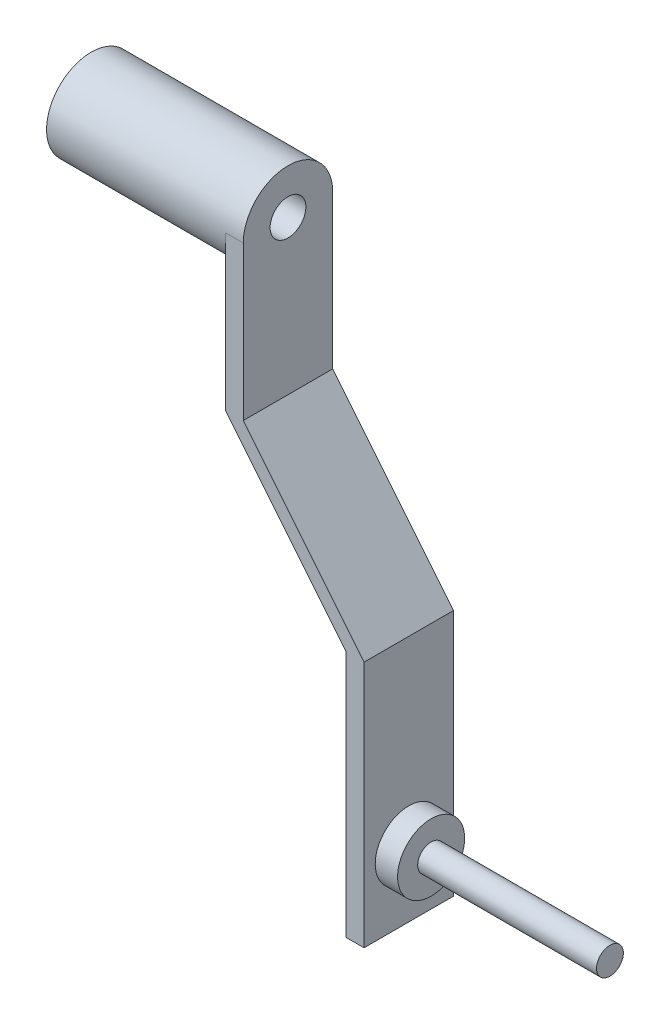
ISO-10303-21;
HEADER;
FILE_DESCRIPTION(('STEP AP214'),'2;1');
FILE_NAME('part.step','',(''),(''),'','','');
FILE_SCHEMA(('AUTOMOTIVE_DESIGN { 1 0 10303 214 1 1 1 1 }'));
ENDSEC;
DATA;
#1=APPLICATION_CONTEXT('core data for automotive mechanical design processes');
#2=APPLICATION_PROTOCOL_DEFINITION('international standard','automotive_design',2000,#1);
#3=PRODUCT_CONTEXT('',#1,'mechanical');
#4=PRODUCT('Part','Part','',(#3));
#5=PRODUCT_RELATED_PRODUCT_CATEGORY('part','',(#4));
#6=PRODUCT_DEFINITION_FORMATION('','',#4);
#7=PRODUCT_DEFINITION_CONTEXT('part definition',#1,'design');
#8=PRODUCT_DEFINITION('design','',#6,#7);
#9=PRODUCT_DEFINITION_SHAPE('','',#8);
#10=(LENGTH_UNIT() NAMED_UNIT(*) SI_UNIT(.MILLI.,.METRE.));
#11=(NAMED_UNIT(*) PLANE_ANGLE_UNIT() SI_UNIT($,.RADIAN.));
#12=(NAMED_UNIT(*) SI_UNIT($,.STERADIAN.) SOLID_ANGLE_UNIT());
#13=UNCERTAINTY_MEASURE_WITH_UNIT(LENGTH_MEASURE(1.E-05),#10,'distance_accuracy_value','');
#14=(GEOMETRIC_REPRESENTATION_CONTEXT(3) GLOBAL_UNCERTAINTY_ASSIGNED_CONTEXT((#13)) GLOBAL_UNIT_ASSIGNED_CONTEXT((#10,
#11,#12)) REPRESENTATION_CONTEXT('',''));
#15=CARTESIAN_POINT('',(0.,0.,0.));
#16=DIRECTION('',(0.,0.,1.));
#17=DIRECTION('',(1.,0.,0.));
#18=AXIS2_PLACEMENT_3D('',#15,#16,#17);
#19=CARTESIAN_POINT('',(20.,0.,0.));
#20=DIRECTION('',(-1.,0.,0.));
#21=DIRECTION('',(0.,0.,1.));
#22=AXIS2_PLACEMENT_3D('',#19,#20,#21);
#23=CYLINDRICAL_SURFACE('',#22,5.);
#24=CARTESIAN_POINT('',(20.,0.,0.));
#25=DIRECTION('',(1.,0.,0.));
#26=DIRECTION('',(0.,0.,-1.));
#27=AXIS2_PLACEMENT_3D('',#24,#25,#26);
#28=CIRCLE('',#27,5.);
#29=CARTESIAN_POINT('',(20.,0.,5.));
#30=VERTEX_POINT('',#29);
#31=CARTESIAN_POINT('',(20.,0.,-5.));
#32=VERTEX_POINT('',#31);
#33=EDGE_CURVE('E40',#30,#32,#28,.T.);
#34=ORIENTED_EDGE('',*,*,#33,.F.);
#35=DIRECTION('',(-1.,0.,0.));
#36=VECTOR('',#35,1.);
#37=CARTESIAN_POINT('',(22.,0.,5.));
#38=LINE('',#37,#36);
#39=CARTESIAN_POINT('',(22.,0.,5.));
#40=VERTEX_POINT('',#39);
#41=EDGE_CURVE('E167',#40,#30,#38,.T.);
#42=ORIENTED_EDGE('',*,*,#41,.F.);
#43=CARTESIAN_POINT('',(22.,0.,0.));
#44=DIRECTION('',(1.,0.,0.));
#45=DIRECTION('',(0.,0.,-1.));
#46=AXIS2_PLACEMENT_3D('',#43,#44,#45);
#47=CIRCLE('',#46,5.);
#48=CARTESIAN_POINT('',(22.,0.,-5.));
#49=VERTEX_POINT('',#48);
#50=EDGE_CURVE('E153',#49,#40,#47,.T.);
#51=ORIENTED_EDGE('',*,*,#50,.F.);
#52=DIRECTION('',(-1.,0.,0.));
#53=VECTOR('',#52,1.);
#54=CARTESIAN_POINT('',(22.,0.,-5.));
#55=LINE('',#54,#53);
#56=EDGE_CURVE('E160',#49,#32,#55,.T.);
#57=ORIENTED_EDGE('',*,*,#56,.T.);
#58=EDGE_LOOP('',(#34,#42,#51,#57));
#59=FACE_BOUND('',#58,.T.);
#60=CARTESIAN_POINT('',(0.,0.,0.));
#61=DIRECTION('',(1.,0.,0.));
#62=DIRECTION('',(0.,0.,-1.));
#63=AXIS2_PLACEMENT_3D('',#60,#61,#62);
#64=CIRCLE('',#63,5.);
#65=CARTESIAN_POINT('',(0.,0.,-5.));
#66=VERTEX_POINT('',#65);
#67=EDGE_CURVE('E164',#66,#66,#64,.T.);
#68=ORIENTED_EDGE('',*,*,#67,.T.);
#69=EDGE_LOOP('',(#68));
#70=FACE_BOUND('',#69,.T.);
#71=ADVANCED_FACE('F33',(#59,#70),#23,.T.);
#72=CARTESIAN_POINT('',(0.,0.,0.));
#73=DIRECTION('',(1.,0.,0.));
#74=DIRECTION('',(0.,0.,-1.));
#75=AXIS2_PLACEMENT_3D('',#72,#73,#74);
#76=PLANE('',#75);
#77=CARTESIAN_POINT('',(0.,0.,0.));
#78=DIRECTION('',(1.,0.,0.));
#79=DIRECTION('',(0.,0.,-1.));
#80=AXIS2_PLACEMENT_3D('',#77,#78,#79);
#81=CIRCLE('',#80,2.);
#82=CARTESIAN_POINT('',(0.,0.,-2.));
#83=VERTEX_POINT('',#82);
#84=EDGE_CURVE('E147',#83,#83,#81,.T.);
#85=ORIENTED_EDGE('',*,*,#84,.T.);
#86=EDGE_LOOP('',(#85));
#87=FACE_BOUND('',#86,.T.);
#88=ORIENTED_EDGE('',*,*,#67,.F.);
#89=EDGE_LOOP('',(#88));
#90=FACE_BOUND('',#89,.T.);
#91=ADVANCED_FACE('F237',(#87,#90),#76,.F.);
#92=CARTESIAN_POINT('',(20.,0.,0.));
#93=DIRECTION('',(1.,0.,0.));
#94=DIRECTION('',(0.,0.,-1.));
#95=AXIS2_PLACEMENT_3D('',#92,#93,#94);
#96=PLANE('',#95);
#97=DIRECTION('',(0.,-1.,0.));
#98=VECTOR('',#97,1.);
#99=CARTESIAN_POINT('',(20.,0.,5.));
#100=LINE('',#99,#98);
#101=CARTESIAN_POINT('',(20.,-17.1852081983021,5.));
#102=VERTEX_POINT('',#101);
#103=EDGE_CURVE('E150',#30,#102,#100,.T.);
#104=ORIENTED_EDGE('',*,*,#103,.F.);
#105=ORIENTED_EDGE('',*,*,#33,.T.);
#106=DIRECTION('',(0.,1.,0.));
#107=VECTOR('',#106,1.);
#108=CARTESIAN_POINT('',(20.,-17.1852081983021,-5.));
#109=LINE('',#108,#107);
#110=CARTESIAN_POINT('',(20.,-17.1852081983021,-5.));
#111=VERTEX_POINT('',#110);
#112=EDGE_CURVE('E155',#111,#32,#109,.T.);
#113=ORIENTED_EDGE('',*,*,#112,.F.);
#114=DIRECTION('',(0.,0.,-1.));
#115=VECTOR('',#114,1.);
#116=CARTESIAN_POINT('',(20.,-17.1852081983021,5.));
#117=LINE('',#116,#115);
#118=EDGE_CURVE('E161',#102,#111,#117,.T.);
#119=ORIENTED_EDGE('',*,*,#118,.F.);
#120=EDGE_LOOP('',(#104,#105,#113,#119));
#121=FACE_BOUND('',#120,.T.);
#122=ADVANCED_FACE('F241',(#121),#96,.F.);
#123=CARTESIAN_POINT('',(22.,0.,5.));
#124=DIRECTION('',(0.,0.,-1.));
#125=DIRECTION('',(-1.,0.,0.));
#126=AXIS2_PLACEMENT_3D('',#123,#124,#125);
#127=PLANE('',#126);
#128=ORIENTED_EDGE('',*,*,#103,.T.);
#129=DIRECTION('',(0.630018518401716,-0.77658010949992,0.));
#130=VECTOR('',#129,1.);
#131=CARTESIAN_POINT('',(20.,-17.1852081983021,5.));
#132=LINE('',#131,#130);
#133=CARTESIAN_POINT('',(33.5069113186328,-33.8342405115736,5.));
#134=VERTEX_POINT('',#133);
#135=EDGE_CURVE('E121',#102,#134,#132,.T.);
#136=ORIENTED_EDGE('',*,*,#135,.T.);
#137=DIRECTION('',(0.,-1.,0.));
#138=VECTOR('',#137,1.);
#139=CARTESIAN_POINT('',(33.5069113186328,-33.8342405115736,5.));
#140=LINE('',#139,#138);
#141=CARTESIAN_POINT('',(33.5069113186328,-61.5014080369507,5.));
#142=VERTEX_POINT('',#141);
#143=EDGE_CURVE('E115',#134,#142,#140,.T.);
#144=ORIENTED_EDGE('',*,*,#143,.T.);
#145=DIRECTION('',(1.,0.,0.));
#146=VECTOR('',#145,1.);
#147=CARTESIAN_POINT('',(33.5069113186328,-61.5014080369507,5.));
#148=LINE('',#147,#146);
#149=CARTESIAN_POINT('',(35.5069113186328,-61.5014080369507,5.));
#150=VERTEX_POINT('',#149);
#151=EDGE_CURVE('E104',#142,#150,#148,.T.);
#152=ORIENTED_EDGE('',*,*,#151,.T.);
#153=DIRECTION('',(0.,1.,0.));
#154=VECTOR('',#153,1.);
#155=CARTESIAN_POINT('',(35.5069113186328,-33.8342405115736,5.));
#156=LINE('',#155,#154);
#157=CARTESIAN_POINT('',(35.5069113186328,-33.8342405115736,5.));
#158=VERTEX_POINT('',#157);
#159=EDGE_CURVE('E114',#150,#158,#156,.T.);
#160=ORIENTED_EDGE('',*,*,#159,.T.);
#161=DIRECTION('',(-0.630018518401716,0.77658010949992,0.));
#162=VECTOR('',#161,1.);
#163=CARTESIAN_POINT('',(22.,-17.1852081983021,5.));
#164=LINE('',#163,#162);
#165=CARTESIAN_POINT('',(22.,-17.1852081983021,5.));
#166=VERTEX_POINT('',#165);
#167=EDGE_CURVE('E138',#158,#166,#164,.T.);
#168=ORIENTED_EDGE('',*,*,#167,.T.);
#169=DIRECTION('',(0.,-1.,0.));
#170=VECTOR('',#169,1.);
#171=CARTESIAN_POINT('',(22.,0.,5.));
#172=LINE('',#171,#170);
#173=EDGE_CURVE('E74',#40,#166,#172,.T.);
#174=ORIENTED_EDGE('',*,*,#173,.F.);
#175=ORIENTED_EDGE('',*,*,#41,.T.);
#176=EDGE_LOOP('',(#128,#136,#144,#152,#160,#168,#174,#175));
#177=FACE_BOUND('',#176,.T.);
#178=ADVANCED_FACE('F119',(#177),#127,.F.);
#179=CARTESIAN_POINT('',(22.,-17.1852081983021,-5.));
#180=DIRECTION('',(0.,0.,1.));
#181=DIRECTION('',(1.,0.,0.));
#182=AXIS2_PLACEMENT_3D('',#179,#180,#181);
#183=PLANE('',#182);
#184=ORIENTED_EDGE('',*,*,#112,.T.);
#185=ORIENTED_EDGE('',*,*,#56,.F.);
#186=DIRECTION('',(0.,1.,0.));
#187=VECTOR('',#186,1.);
#188=CARTESIAN_POINT('',(22.,-17.1852081983021,-5.));
#189=LINE('',#188,#187);
#190=CARTESIAN_POINT('',(22.,-17.1852081983021,-5.));
#191=VERTEX_POINT('',#190);
#192=EDGE_CURVE('E55',#191,#49,#189,.T.);
#193=ORIENTED_EDGE('',*,*,#192,.F.);
#194=DIRECTION('',(-0.630018518401716,0.77658010949992,0.));
#195=VECTOR('',#194,1.);
#196=CARTESIAN_POINT('',(22.,-17.1852081983021,-5.));
#197=LINE('',#196,#195);
#198=CARTESIAN_POINT('',(35.5069113186328,-33.8342405115736,-5.));
#199=VERTEX_POINT('',#198);
#200=EDGE_CURVE('E132',#199,#191,#197,.T.);
#201=ORIENTED_EDGE('',*,*,#200,.F.);
#202=DIRECTION('',(0.,1.,0.));
#203=VECTOR('',#202,1.);
#204=CARTESIAN_POINT('',(35.5069113186328,-33.8342405115736,-5.));
#205=LINE('',#204,#203);
#206=CARTESIAN_POINT('',(35.5069113186328,-61.5014080369507,-5.));
#207=VERTEX_POINT('',#206);
#208=EDGE_CURVE('E125',#207,#199,#205,.T.);
#209=ORIENTED_EDGE('',*,*,#208,.F.);
#210=DIRECTION('',(1.,0.,0.));
#211=VECTOR('',#210,1.);
#212=CARTESIAN_POINT('',(33.5069113186328,-61.5014080369507,-5.));
#213=LINE('',#212,#211);
#214=CARTESIAN_POINT('',(33.5069113186328,-61.5014080369507,-5.));
#215=VERTEX_POINT('',#214);
#216=EDGE_CURVE('E195',#215,#207,#213,.T.);
#217=ORIENTED_EDGE('',*,*,#216,.F.);
#218=DIRECTION('',(0.,-1.,0.));
#219=VECTOR('',#218,1.);
#220=CARTESIAN_POINT('',(33.5069113186328,-33.8342405115736,-5.));
#221=LINE('',#220,#219);
#222=CARTESIAN_POINT('',(33.5069113186328,-33.8342405115736,-5.));
#223=VERTEX_POINT('',#222);
#224=EDGE_CURVE('E129',#223,#215,#221,.T.);
#225=ORIENTED_EDGE('',*,*,#224,.F.);
#226=DIRECTION('',(0.630018518401716,-0.77658010949992,0.));
#227=VECTOR('',#226,1.);
#228=CARTESIAN_POINT('',(20.,-17.1852081983021,-5.));
#229=LINE('',#228,#227);
#230=EDGE_CURVE('E130',#111,#223,#229,.T.);
#231=ORIENTED_EDGE('',*,*,#230,.F.);
#232=EDGE_LOOP('',(#184,#185,#193,#201,#209,#217,#225,#231));
#233=FACE_BOUND('',#232,.T.);
#234=ADVANCED_FACE('F192',(#233),#183,.F.);
#235=CARTESIAN_POINT('',(22.,0.,0.));
#236=DIRECTION('',(1.,0.,0.));
#237=DIRECTION('',(0.,0.,-1.));
#238=AXIS2_PLACEMENT_3D('',#235,#236,#237);
#239=PLANE('',#238);
#240=CARTESIAN_POINT('',(22.,0.,0.));
#241=DIRECTION('',(1.,0.,0.));
#242=DIRECTION('',(0.,0.,-1.));
#243=AXIS2_PLACEMENT_3D('',#240,#241,#242);
#244=CIRCLE('',#243,2.);
#245=CARTESIAN_POINT('',(22.,0.,-2.));
#246=VERTEX_POINT('',#245);
#247=EDGE_CURVE('E146',#246,#246,#244,.T.);
#248=ORIENTED_EDGE('',*,*,#247,.F.);
#249=EDGE_LOOP('',(#248));
#250=FACE_BOUND('',#249,.T.);
#251=ORIENTED_EDGE('',*,*,#50,.T.);
#252=ORIENTED_EDGE('',*,*,#173,.T.);
#253=DIRECTION('',(0.,0.,-1.));
#254=VECTOR('',#253,1.);
#255=CARTESIAN_POINT('',(22.,-17.1852081983021,5.));
#256=LINE('',#255,#254);
#257=EDGE_CURVE('E157',#166,#191,#256,.T.);
#258=ORIENTED_EDGE('',*,*,#257,.T.);
#259=ORIENTED_EDGE('',*,*,#192,.T.);
#260=EDGE_LOOP('',(#251,#252,#258,#259));
#261=FACE_BOUND('',#260,.T.);
#262=ADVANCED_FACE('F183',(#250,#261),#239,.T.);
#263=CARTESIAN_POINT('',(0.,0.,0.));
#264=DIRECTION('',(1.,0.,0.));
#265=DIRECTION('',(0.,0.,-1.));
#266=AXIS2_PLACEMENT_3D('',#263,#264,#265);
#267=CYLINDRICAL_SURFACE('',#266,2.);
#268=ORIENTED_EDGE('',*,*,#84,.F.);
#269=EDGE_LOOP('',(#268));
#270=FACE_BOUND('',#269,.T.);
#271=ORIENTED_EDGE('',*,*,#247,.T.);
#272=EDGE_LOOP('',(#271));
#273=FACE_BOUND('',#272,.T.);
#274=ADVANCED_FACE('F255',(#270,#273),#267,.F.);
#275=CARTESIAN_POINT('',(20.,-17.1852081983021,5.));
#276=DIRECTION('',(0.77658010949992,0.630018518401716,0.));
#277=DIRECTION('',(-0.630018518401716,0.77658010949992,0.));
#278=AXIS2_PLACEMENT_3D('',#275,#276,#277);
#279=PLANE('',#278);
#280=ORIENTED_EDGE('',*,*,#230,.T.);
#281=DIRECTION('',(0.,0.,-1.));
#282=VECTOR('',#281,1.);
#283=CARTESIAN_POINT('',(33.5069113186328,-33.8342405115736,5.));
#284=LINE('',#283,#282);
#285=EDGE_CURVE('E144',#134,#223,#284,.T.);
#286=ORIENTED_EDGE('',*,*,#285,.F.);
#287=ORIENTED_EDGE('',*,*,#135,.F.);
#288=ORIENTED_EDGE('',*,*,#118,.T.);
#289=EDGE_LOOP('',(#280,#286,#287,#288));
#290=FACE_BOUND('',#289,.T.);
#291=ADVANCED_FACE('F259',(#290),#279,.F.);
#292=CARTESIAN_POINT('',(22.,-17.1852081983021,5.));
#293=DIRECTION('',(-0.776580109499919,-0.630018518401716,0.));
#294=DIRECTION('',(0.630018518401716,-0.776580109499919,0.));
#295=AXIS2_PLACEMENT_3D('',#292,#293,#294);
#296=PLANE('',#295);
#297=ORIENTED_EDGE('',*,*,#200,.T.);
#298=ORIENTED_EDGE('',*,*,#257,.F.);
#299=ORIENTED_EDGE('',*,*,#167,.F.);
#300=DIRECTION('',(0.,0.,-1.));
#301=VECTOR('',#300,1.);
#302=CARTESIAN_POINT('',(35.5069113186328,-33.8342405115736,5.));
#303=LINE('',#302,#301);
#304=EDGE_CURVE('E139',#158,#199,#303,.T.);
#305=ORIENTED_EDGE('',*,*,#304,.T.);
#306=EDGE_LOOP('',(#297,#298,#299,#305));
#307=FACE_BOUND('',#306,.T.);
#308=ADVANCED_FACE('F187',(#307),#296,.F.);
#309=CARTESIAN_POINT('',(33.5069113186328,-33.8342405115736,5.));
#310=DIRECTION('',(1.,0.,0.));
#311=DIRECTION('',(0.,0.,-1.));
#312=AXIS2_PLACEMENT_3D('',#309,#310,#311);
#313=PLANE('',#312);
#314=ORIENTED_EDGE('',*,*,#224,.T.);
#315=DIRECTION('',(0.,0.,-1.));
#316=VECTOR('',#315,1.);
#317=CARTESIAN_POINT('',(33.5069113186328,-61.5014080369507,5.));
#318=LINE('',#317,#316);
#319=EDGE_CURVE('E108',#142,#215,#318,.T.);
#320=ORIENTED_EDGE('',*,*,#319,.F.);
#321=ORIENTED_EDGE('',*,*,#143,.F.);
#322=ORIENTED_EDGE('',*,*,#285,.T.);
#323=EDGE_LOOP('',(#314,#320,#321,#322));
#324=FACE_BOUND('',#323,.T.);
#325=ADVANCED_FACE('F127',(#324),#313,.F.);
#326=CARTESIAN_POINT('',(33.5069113186328,-61.5014080369507,5.));
#327=DIRECTION('',(0.,1.,0.));
#328=DIRECTION('',(0.,0.,1.));
#329=AXIS2_PLACEMENT_3D('',#326,#327,#328);
#330=PLANE('',#329);
#331=ORIENTED_EDGE('',*,*,#216,.T.);
#332=DIRECTION('',(0.,0.,-1.));
#333=VECTOR('',#332,1.);
#334=CARTESIAN_POINT('',(35.5069113186328,-61.5014080369507,5.));
#335=LINE('',#334,#333);
#336=EDGE_CURVE('E111',#150,#207,#335,.T.);
#337=ORIENTED_EDGE('',*,*,#336,.F.);
#338=ORIENTED_EDGE('',*,*,#151,.F.);
#339=ORIENTED_EDGE('',*,*,#319,.T.);
#340=EDGE_LOOP('',(#331,#337,#338,#339));
#341=FACE_BOUND('',#340,.T.);
#342=ADVANCED_FACE('F106',(#341),#330,.F.);
#343=CARTESIAN_POINT('',(35.5069113186328,-33.8342405115736,5.));
#344=DIRECTION('',(-1.,0.,0.));
#345=DIRECTION('',(0.,0.,1.));
#346=AXIS2_PLACEMENT_3D('',#343,#344,#345);
#347=PLANE('',#346);
#348=CARTESIAN_POINT('',(35.5069113186328,-54.0014080369507,0.));
#349=DIRECTION('',(-1.,0.,0.));
#350=DIRECTION('',(0.,0.,1.));
#351=AXIS2_PLACEMENT_3D('',#348,#349,#350);
#352=CIRCLE('',#351,3.75);
#353=CARTESIAN_POINT('',(35.5069113186328,-54.0014080369507,3.75));
#354=VERTEX_POINT('',#353);
#355=EDGE_CURVE('E11',#354,#354,#352,.F.);
#356=ORIENTED_EDGE('',*,*,#355,.F.);
#357=EDGE_LOOP('',(#356));
#358=FACE_BOUND('',#357,.T.);
#359=ORIENTED_EDGE('',*,*,#208,.T.);
#360=ORIENTED_EDGE('',*,*,#304,.F.);
#361=ORIENTED_EDGE('',*,*,#159,.F.);
#362=ORIENTED_EDGE('',*,*,#336,.T.);
#363=EDGE_LOOP('',(#359,#360,#361,#362));
#364=FACE_BOUND('',#363,.T.);
#365=ADVANCED_FACE('F194',(#358,#364),#347,.F.);
#366=CARTESIAN_POINT('',(38.0069113186328,-54.0014080369507,0.));
#367=DIRECTION('',(-1.,0.,0.));
#368=DIRECTION('',(0.,0.,1.));
#369=AXIS2_PLACEMENT_3D('',#366,#367,#368);
#370=CYLINDRICAL_SURFACE('',#369,3.75);
#371=CARTESIAN_POINT('',(38.0069113186328,-54.0014080369507,0.));
#372=DIRECTION('',(1.,0.,0.));
#373=DIRECTION('',(0.,0.,-1.));
#374=AXIS2_PLACEMENT_3D('',#371,#372,#373);
#375=CIRCLE('',#374,3.75);
#376=CARTESIAN_POINT('',(38.0069113186328,-54.0014080369507,-3.75));
#377=VERTEX_POINT('',#376);
#378=EDGE_CURVE('E199',#377,#377,#375,.T.);
#379=ORIENTED_EDGE('',*,*,#378,.F.);
#380=EDGE_LOOP('',(#379));
#381=FACE_BOUND('',#380,.T.);
#382=ORIENTED_EDGE('',*,*,#355,.T.);
#383=EDGE_LOOP('',(#382));
#384=FACE_BOUND('',#383,.T.);
#385=ADVANCED_FACE('F221',(#381,#384),#370,.T.);
#386=CARTESIAN_POINT('',(38.0069113186328,-54.0014080369507,0.));
#387=DIRECTION('',(1.,0.,0.));
#388=DIRECTION('',(0.,0.,-1.));
#389=AXIS2_PLACEMENT_3D('',#386,#387,#388);
#390=PLANE('',#389);
#391=CARTESIAN_POINT('',(38.0069113186328,-54.0014080369507,0.));
#392=DIRECTION('',(1.,0.,0.));
#393=DIRECTION('',(0.,0.,-1.));
#394=AXIS2_PLACEMENT_3D('',#391,#392,#393);
#395=CIRCLE('',#394,1.5);
#396=CARTESIAN_POINT('',(38.0069113186328,-54.0014080369507,-1.5));
#397=VERTEX_POINT('',#396);
#398=EDGE_CURVE('E204',#397,#397,#395,.T.);
#399=ORIENTED_EDGE('',*,*,#398,.F.);
#400=EDGE_LOOP('',(#399));
#401=FACE_BOUND('',#400,.T.);
#402=ORIENTED_EDGE('',*,*,#378,.T.);
#403=EDGE_LOOP('',(#402));
#404=FACE_BOUND('',#403,.T.);
#405=ADVANCED_FACE('F215',(#401,#404),#390,.T.);
#406=CARTESIAN_POINT('',(58.0069113186328,-54.0014080369507,0.));
#407=DIRECTION('',(-1.,0.,0.));
#408=DIRECTION('',(0.,0.,1.));
#409=AXIS2_PLACEMENT_3D('',#406,#407,#408);
#410=CYLINDRICAL_SURFACE('',#409,1.5);
#411=CARTESIAN_POINT('',(58.0069113186328,-54.0014080369507,0.));
#412=DIRECTION('',(1.,0.,0.));
#413=DIRECTION('',(0.,0.,-1.));
#414=AXIS2_PLACEMENT_3D('',#411,#412,#413);
#415=CIRCLE('',#414,1.5);
#416=CARTESIAN_POINT('',(58.0069113186328,-54.0014080369507,-1.5));
#417=VERTEX_POINT('',#416);
#418=EDGE_CURVE('E203',#417,#417,#415,.T.);
#419=ORIENTED_EDGE('',*,*,#418,.F.);
#420=EDGE_LOOP('',(#419));
#421=FACE_BOUND('',#420,.T.);
#422=ORIENTED_EDGE('',*,*,#398,.T.);
#423=EDGE_LOOP('',(#422));
#424=FACE_BOUND('',#423,.T.);
#425=ADVANCED_FACE('F212',(#421,#424),#410,.T.);
#426=CARTESIAN_POINT('',(58.0069113186328,-54.0014080369507,0.));
#427=DIRECTION('',(1.,0.,0.));
#428=DIRECTION('',(0.,0.,-1.));
#429=AXIS2_PLACEMENT_3D('',#426,#427,#428);
#430=PLANE('',#429);
#431=ORIENTED_EDGE('',*,*,#418,.T.);
#432=EDGE_LOOP('',(#431));
#433=FACE_BOUND('',#432,.T.);
#434=ADVANCED_FACE('F210',(#433),#430,.T.);
#435=CLOSED_SHELL('',(#71,#91,#122,#178,#234,#262,#274,#291,#308,#325,#342,#365,#385,#405,#425,#434));
#436=MANIFOLD_SOLID_BREP('B2',#435);
#437=ADVANCED_BREP_SHAPE_REPRESENTATION('',(#18,#436),#14);
#438=SHAPE_DEFINITION_REPRESENTATION(#9,#437);
ENDSEC;
END-ISO-10303-21;
